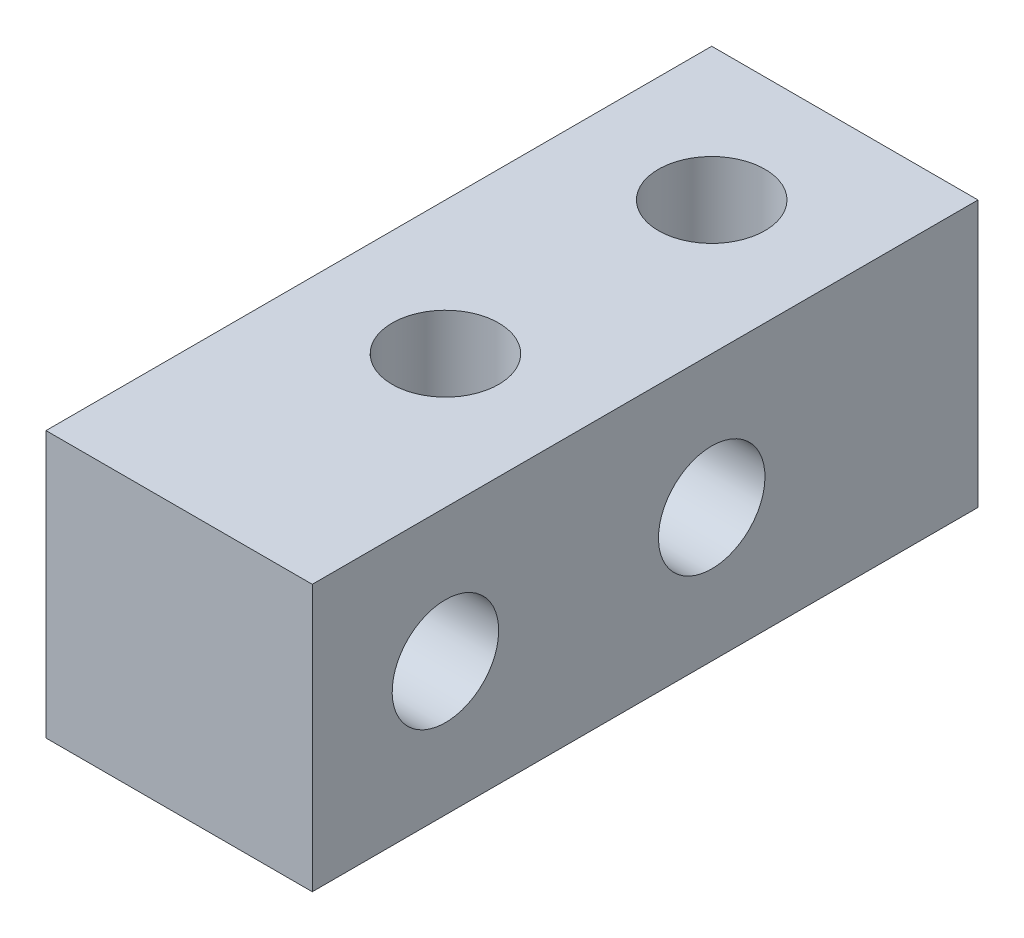
ISO-10303-21;
HEADER;
FILE_DESCRIPTION(('STEP AP214'),'2;1');
FILE_NAME('part.step','',(''),(''),'','','');
FILE_SCHEMA(('AUTOMOTIVE_DESIGN { 1 0 10303 214 1 1 1 1 }'));
ENDSEC;
DATA;
#1=APPLICATION_CONTEXT('core data for automotive mechanical design processes');
#2=APPLICATION_PROTOCOL_DEFINITION('international standard','automotive_design',2000,#1);
#3=PRODUCT_CONTEXT('',#1,'mechanical');
#4=PRODUCT('Part','Part','',(#3));
#5=PRODUCT_RELATED_PRODUCT_CATEGORY('part','',(#4));
#6=PRODUCT_DEFINITION_FORMATION('','',#4);
#7=PRODUCT_DEFINITION_CONTEXT('part definition',#1,'design');
#8=PRODUCT_DEFINITION('design','',#6,#7);
#9=PRODUCT_DEFINITION_SHAPE('','',#8);
#10=(LENGTH_UNIT() NAMED_UNIT(*) SI_UNIT(.MILLI.,.METRE.));
#11=(NAMED_UNIT(*) PLANE_ANGLE_UNIT() SI_UNIT($,.RADIAN.));
#12=(NAMED_UNIT(*) SI_UNIT($,.STERADIAN.) SOLID_ANGLE_UNIT());
#13=UNCERTAINTY_MEASURE_WITH_UNIT(LENGTH_MEASURE(1.E-05),#10,'distance_accuracy_value','');
#14=(GEOMETRIC_REPRESENTATION_CONTEXT(3) GLOBAL_UNCERTAINTY_ASSIGNED_CONTEXT((#13)) GLOBAL_UNIT_ASSIGNED_CONTEXT((#10,
#11,#12)) REPRESENTATION_CONTEXT('',''));
#15=CARTESIAN_POINT('',(0.,0.,0.));
#16=DIRECTION('',(0.,0.,1.));
#17=DIRECTION('',(1.,0.,0.));
#18=AXIS2_PLACEMENT_3D('',#15,#16,#17);
#19=CARTESIAN_POINT('',(5.,5.,12.5));
#20=DIRECTION('',(-1.,0.,0.));
#21=DIRECTION('',(0.,-1.,0.));
#22=AXIS2_PLACEMENT_3D('',#19,#20,#21);
#23=PLANE('',#22);
#24=CARTESIAN_POINT('',(5.,0.,7.5));
#25=DIRECTION('',(1.,0.,0.));
#26=DIRECTION('',(0.,1.,0.));
#27=AXIS2_PLACEMENT_3D('',#24,#25,#26);
#28=CIRCLE('',#27,2.);
#29=CARTESIAN_POINT('',(5.,2.,7.5));
#30=VERTEX_POINT('',#29);
#31=EDGE_CURVE('E112',#30,#30,#28,.T.);
#32=ORIENTED_EDGE('',*,*,#31,.F.);
#33=EDGE_LOOP('',(#32));
#34=FACE_BOUND('',#33,.T.);
#35=CARTESIAN_POINT('',(5.,0.,-2.5));
#36=DIRECTION('',(1.,0.,0.));
#37=DIRECTION('',(0.,1.,0.));
#38=AXIS2_PLACEMENT_3D('',#35,#36,#37);
#39=CIRCLE('',#38,2.);
#40=CARTESIAN_POINT('',(5.,2.,-2.5));
#41=VERTEX_POINT('',#40);
#42=EDGE_CURVE('E120',#41,#41,#39,.T.);
#43=ORIENTED_EDGE('',*,*,#42,.F.);
#44=EDGE_LOOP('',(#43));
#45=FACE_BOUND('',#44,.T.);
#46=DIRECTION('',(0.,1.,0.));
#47=VECTOR('',#46,1.);
#48=CARTESIAN_POINT('',(5.,5.,-12.5));
#49=LINE('',#48,#47);
#50=CARTESIAN_POINT('',(5.,-5.,-12.5));
#51=VERTEX_POINT('',#50);
#52=CARTESIAN_POINT('',(5.,5.,-12.5));
#53=VERTEX_POINT('',#52);
#54=EDGE_CURVE('E100',#51,#53,#49,.T.);
#55=ORIENTED_EDGE('',*,*,#54,.T.);
#56=DIRECTION('',(0.,0.,-1.));
#57=VECTOR('',#56,1.);
#58=CARTESIAN_POINT('',(5.,5.,12.5));
#59=LINE('',#58,#57);
#60=CARTESIAN_POINT('',(5.,5.,12.5));
#61=VERTEX_POINT('',#60);
#62=EDGE_CURVE('E11',#61,#53,#59,.T.);
#63=ORIENTED_EDGE('',*,*,#62,.F.);
#64=DIRECTION('',(0.,1.,0.));
#65=VECTOR('',#64,1.);
#66=CARTESIAN_POINT('',(5.,5.,12.5));
#67=LINE('',#66,#65);
#68=CARTESIAN_POINT('',(5.,-5.,12.5));
#69=VERTEX_POINT('',#68);
#70=EDGE_CURVE('E87',#69,#61,#67,.T.);
#71=ORIENTED_EDGE('',*,*,#70,.F.);
#72=DIRECTION('',(0.,0.,-1.));
#73=VECTOR('',#72,1.);
#74=CARTESIAN_POINT('',(5.,-5.,12.5));
#75=LINE('',#74,#73);
#76=EDGE_CURVE('E96',#69,#51,#75,.T.);
#77=ORIENTED_EDGE('',*,*,#76,.T.);
#78=EDGE_LOOP('',(#55,#63,#71,#77));
#79=FACE_BOUND('',#78,.T.);
#80=ADVANCED_FACE('F34',(#34,#45,#79),#23,.F.);
#81=CARTESIAN_POINT('',(-5.,5.,12.5));
#82=DIRECTION('',(0.,-1.,0.));
#83=DIRECTION('',(0.,0.,-1.));
#84=AXIS2_PLACEMENT_3D('',#81,#82,#83);
#85=PLANE('',#84);
#86=CARTESIAN_POINT('',(0.,5.,-7.5));
#87=DIRECTION('',(0.,1.,0.));
#88=DIRECTION('',(0.,0.,1.));
#89=AXIS2_PLACEMENT_3D('',#86,#87,#88);
#90=CIRCLE('',#89,2.);
#91=CARTESIAN_POINT('',(0.,5.,-5.5));
#92=VERTEX_POINT('',#91);
#93=EDGE_CURVE('E116',#92,#92,#90,.T.);
#94=ORIENTED_EDGE('',*,*,#93,.F.);
#95=EDGE_LOOP('',(#94));
#96=FACE_BOUND('',#95,.T.);
#97=CARTESIAN_POINT('',(0.,5.,2.5));
#98=DIRECTION('',(0.,1.,0.));
#99=DIRECTION('',(0.,0.,1.));
#100=AXIS2_PLACEMENT_3D('',#97,#98,#99);
#101=CIRCLE('',#100,2.);
#102=CARTESIAN_POINT('',(0.,5.,4.5));
#103=VERTEX_POINT('',#102);
#104=EDGE_CURVE('E122',#103,#103,#101,.T.);
#105=ORIENTED_EDGE('',*,*,#104,.F.);
#106=EDGE_LOOP('',(#105));
#107=FACE_BOUND('',#106,.T.);
#108=DIRECTION('',(-1.,0.,0.));
#109=VECTOR('',#108,1.);
#110=CARTESIAN_POINT('',(-5.,5.,-12.5));
#111=LINE('',#110,#109);
#112=CARTESIAN_POINT('',(-5.,5.,-12.5));
#113=VERTEX_POINT('',#112);
#114=EDGE_CURVE('E91',#53,#113,#111,.T.);
#115=ORIENTED_EDGE('',*,*,#114,.T.);
#116=DIRECTION('',(0.,0.,-1.));
#117=VECTOR('',#116,1.);
#118=CARTESIAN_POINT('',(-5.,5.,12.5));
#119=LINE('',#118,#117);
#120=CARTESIAN_POINT('',(-5.,5.,12.5));
#121=VERTEX_POINT('',#120);
#122=EDGE_CURVE('E43',#121,#113,#119,.T.);
#123=ORIENTED_EDGE('',*,*,#122,.F.);
#124=DIRECTION('',(-1.,0.,0.));
#125=VECTOR('',#124,1.);
#126=CARTESIAN_POINT('',(-5.,5.,12.5));
#127=LINE('',#126,#125);
#128=EDGE_CURVE('E82',#61,#121,#127,.T.);
#129=ORIENTED_EDGE('',*,*,#128,.F.);
#130=ORIENTED_EDGE('',*,*,#62,.T.);
#131=EDGE_LOOP('',(#115,#123,#129,#130));
#132=FACE_BOUND('',#131,.T.);
#133=ADVANCED_FACE('F90',(#96,#107,#132),#85,.F.);
#134=CARTESIAN_POINT('',(-5.,5.,12.5));
#135=DIRECTION('',(1.,0.,0.));
#136=DIRECTION('',(0.,1.,0.));
#137=AXIS2_PLACEMENT_3D('',#134,#135,#136);
#138=PLANE('',#137);
#139=CARTESIAN_POINT('',(-5.,0.,7.5));
#140=DIRECTION('',(1.,0.,0.));
#141=DIRECTION('',(0.,1.,0.));
#142=AXIS2_PLACEMENT_3D('',#139,#140,#141);
#143=CIRCLE('',#142,2.);
#144=CARTESIAN_POINT('',(-5.,2.,7.5));
#145=VERTEX_POINT('',#144);
#146=EDGE_CURVE('E103',#145,#145,#143,.T.);
#147=ORIENTED_EDGE('',*,*,#146,.T.);
#148=EDGE_LOOP('',(#147));
#149=FACE_BOUND('',#148,.T.);
#150=CARTESIAN_POINT('',(-5.,0.,-2.5));
#151=DIRECTION('',(1.,0.,0.));
#152=DIRECTION('',(0.,1.,0.));
#153=AXIS2_PLACEMENT_3D('',#150,#151,#152);
#154=CIRCLE('',#153,2.);
#155=CARTESIAN_POINT('',(-5.,2.,-2.5));
#156=VERTEX_POINT('',#155);
#157=EDGE_CURVE('E109',#156,#156,#154,.T.);
#158=ORIENTED_EDGE('',*,*,#157,.T.);
#159=EDGE_LOOP('',(#158));
#160=FACE_BOUND('',#159,.T.);
#161=DIRECTION('',(0.,-1.,0.));
#162=VECTOR('',#161,1.);
#163=CARTESIAN_POINT('',(-5.,5.,-12.5));
#164=LINE('',#163,#162);
#165=CARTESIAN_POINT('',(-5.,-5.,-12.5));
#166=VERTEX_POINT('',#165);
#167=EDGE_CURVE('E69',#113,#166,#164,.T.);
#168=ORIENTED_EDGE('',*,*,#167,.T.);
#169=DIRECTION('',(0.,0.,-1.));
#170=VECTOR('',#169,1.);
#171=CARTESIAN_POINT('',(-5.,-5.,12.5));
#172=LINE('',#171,#170);
#173=CARTESIAN_POINT('',(-5.,-5.,12.5));
#174=VERTEX_POINT('',#173);
#175=EDGE_CURVE('E92',#174,#166,#172,.T.);
#176=ORIENTED_EDGE('',*,*,#175,.F.);
#177=DIRECTION('',(0.,-1.,0.));
#178=VECTOR('',#177,1.);
#179=CARTESIAN_POINT('',(-5.,5.,12.5));
#180=LINE('',#179,#178);
#181=EDGE_CURVE('E85',#121,#174,#180,.T.);
#182=ORIENTED_EDGE('',*,*,#181,.F.);
#183=ORIENTED_EDGE('',*,*,#122,.T.);
#184=EDGE_LOOP('',(#168,#176,#182,#183));
#185=FACE_BOUND('',#184,.T.);
#186=ADVANCED_FACE('F94',(#149,#160,#185),#138,.F.);
#187=CARTESIAN_POINT('',(-5.,-5.,12.5));
#188=DIRECTION('',(0.,1.,0.));
#189=DIRECTION('',(0.,0.,1.));
#190=AXIS2_PLACEMENT_3D('',#187,#188,#189);
#191=PLANE('',#190);
#192=CARTESIAN_POINT('',(0.,-5.,-7.5));
#193=DIRECTION('',(0.,1.,0.));
#194=DIRECTION('',(0.,0.,1.));
#195=AXIS2_PLACEMENT_3D('',#192,#193,#194);
#196=CIRCLE('',#195,2.);
#197=CARTESIAN_POINT('',(0.,-5.,-5.5));
#198=VERTEX_POINT('',#197);
#199=EDGE_CURVE('E37',#198,#198,#196,.T.);
#200=ORIENTED_EDGE('',*,*,#199,.T.);
#201=EDGE_LOOP('',(#200));
#202=FACE_BOUND('',#201,.T.);
#203=CARTESIAN_POINT('',(0.,-5.,2.5));
#204=DIRECTION('',(0.,1.,0.));
#205=DIRECTION('',(0.,0.,1.));
#206=AXIS2_PLACEMENT_3D('',#203,#204,#205);
#207=CIRCLE('',#206,2.);
#208=CARTESIAN_POINT('',(0.,-5.,4.5));
#209=VERTEX_POINT('',#208);
#210=EDGE_CURVE('E114',#209,#209,#207,.T.);
#211=ORIENTED_EDGE('',*,*,#210,.T.);
#212=EDGE_LOOP('',(#211));
#213=FACE_BOUND('',#212,.T.);
#214=DIRECTION('',(1.,0.,0.));
#215=VECTOR('',#214,1.);
#216=CARTESIAN_POINT('',(-5.,-5.,-12.5));
#217=LINE('',#216,#215);
#218=EDGE_CURVE('E75',#166,#51,#217,.T.);
#219=ORIENTED_EDGE('',*,*,#218,.T.);
#220=ORIENTED_EDGE('',*,*,#76,.F.);
#221=DIRECTION('',(1.,0.,0.));
#222=VECTOR('',#221,1.);
#223=CARTESIAN_POINT('',(-5.,-5.,12.5));
#224=LINE('',#223,#222);
#225=EDGE_CURVE('E52',#174,#69,#224,.T.);
#226=ORIENTED_EDGE('',*,*,#225,.F.);
#227=ORIENTED_EDGE('',*,*,#175,.T.);
#228=EDGE_LOOP('',(#219,#220,#226,#227));
#229=FACE_BOUND('',#228,.T.);
#230=ADVANCED_FACE('F151',(#202,#213,#229),#191,.F.);
#231=CARTESIAN_POINT('',(0.,0.,12.5));
#232=DIRECTION('',(0.,0.,1.));
#233=DIRECTION('',(1.,0.,0.));
#234=AXIS2_PLACEMENT_3D('',#231,#232,#233);
#235=PLANE('',#234);
#236=ORIENTED_EDGE('',*,*,#70,.T.);
#237=ORIENTED_EDGE('',*,*,#128,.T.);
#238=ORIENTED_EDGE('',*,*,#181,.T.);
#239=ORIENTED_EDGE('',*,*,#225,.T.);
#240=EDGE_LOOP('',(#236,#237,#238,#239));
#241=FACE_BOUND('',#240,.T.);
#242=ADVANCED_FACE('F83',(#241),#235,.T.);
#243=CARTESIAN_POINT('',(0.,0.,-12.5));
#244=DIRECTION('',(0.,0.,1.));
#245=DIRECTION('',(1.,0.,0.));
#246=AXIS2_PLACEMENT_3D('',#243,#244,#245);
#247=PLANE('',#246);
#248=ORIENTED_EDGE('',*,*,#54,.F.);
#249=ORIENTED_EDGE('',*,*,#218,.F.);
#250=ORIENTED_EDGE('',*,*,#167,.F.);
#251=ORIENTED_EDGE('',*,*,#114,.F.);
#252=EDGE_LOOP('',(#248,#249,#250,#251));
#253=FACE_BOUND('',#252,.T.);
#254=ADVANCED_FACE('F142',(#253),#247,.F.);
#255=CARTESIAN_POINT('',(-20.,0.,-2.5));
#256=DIRECTION('',(1.,0.,0.));
#257=DIRECTION('',(0.,1.,0.));
#258=AXIS2_PLACEMENT_3D('',#255,#256,#257);
#259=CYLINDRICAL_SURFACE('',#258,2.);
#260=ORIENTED_EDGE('',*,*,#42,.T.);
#261=EDGE_LOOP('',(#260));
#262=FACE_BOUND('',#261,.T.);
#263=ORIENTED_EDGE('',*,*,#157,.F.);
#264=EDGE_LOOP('',(#263));
#265=FACE_BOUND('',#264,.T.);
#266=ADVANCED_FACE('F134',(#262,#265),#259,.F.);
#267=CARTESIAN_POINT('',(-20.,0.,7.5));
#268=DIRECTION('',(1.,0.,0.));
#269=DIRECTION('',(0.,1.,0.));
#270=AXIS2_PLACEMENT_3D('',#267,#268,#269);
#271=CYLINDRICAL_SURFACE('',#270,2.);
#272=ORIENTED_EDGE('',*,*,#31,.T.);
#273=EDGE_LOOP('',(#272));
#274=FACE_BOUND('',#273,.T.);
#275=ORIENTED_EDGE('',*,*,#146,.F.);
#276=EDGE_LOOP('',(#275));
#277=FACE_BOUND('',#276,.T.);
#278=ADVANCED_FACE('F149',(#274,#277),#271,.F.);
#279=CARTESIAN_POINT('',(0.,-20.,2.5));
#280=DIRECTION('',(0.,1.,0.));
#281=DIRECTION('',(0.,0.,1.));
#282=AXIS2_PLACEMENT_3D('',#279,#280,#281);
#283=CYLINDRICAL_SURFACE('',#282,2.);
#284=ORIENTED_EDGE('',*,*,#104,.T.);
#285=EDGE_LOOP('',(#284));
#286=FACE_BOUND('',#285,.T.);
#287=ORIENTED_EDGE('',*,*,#210,.F.);
#288=EDGE_LOOP('',(#287));
#289=FACE_BOUND('',#288,.T.);
#290=ADVANCED_FACE('F166',(#286,#289),#283,.F.);
#291=CARTESIAN_POINT('',(0.,-20.,-7.5));
#292=DIRECTION('',(0.,1.,0.));
#293=DIRECTION('',(0.,0.,1.));
#294=AXIS2_PLACEMENT_3D('',#291,#292,#293);
#295=CYLINDRICAL_SURFACE('',#294,2.);
#296=ORIENTED_EDGE('',*,*,#93,.T.);
#297=EDGE_LOOP('',(#296));
#298=FACE_BOUND('',#297,.T.);
#299=ORIENTED_EDGE('',*,*,#199,.F.);
#300=EDGE_LOOP('',(#299));
#301=FACE_BOUND('',#300,.T.);
#302=ADVANCED_FACE('F169',(#298,#301),#295,.F.);
#303=CLOSED_SHELL('',(#80,#133,#186,#230,#242,#254,#266,#278,#290,#302));
#304=MANIFOLD_SOLID_BREP('B2',#303);
#305=ADVANCED_BREP_SHAPE_REPRESENTATION('',(#18,#304),#14);
#306=SHAPE_DEFINITION_REPRESENTATION(#9,#305);
ENDSEC;
END-ISO-10303-21;
